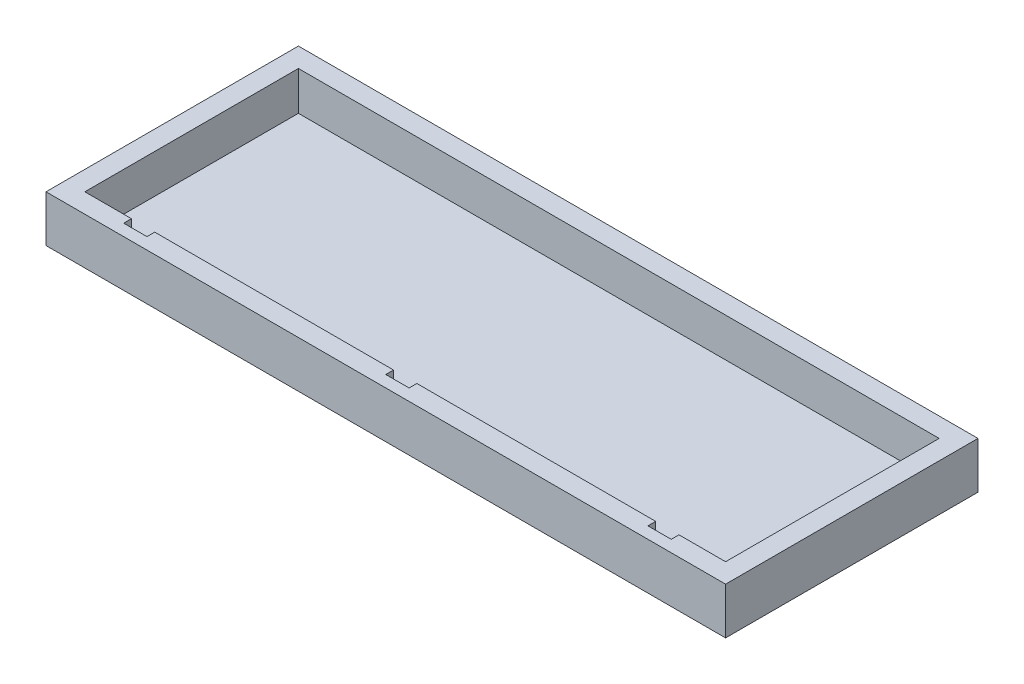
ISO-10303-21;
HEADER;
FILE_DESCRIPTION(('STEP AP214'),'2;1');
FILE_NAME('part.step','',(''),(''),'','','');
FILE_SCHEMA(('AUTOMOTIVE_DESIGN { 1 0 10303 214 1 1 1 1 }'));
ENDSEC;
DATA;
#1=APPLICATION_CONTEXT('core data for automotive mechanical design processes');
#2=APPLICATION_PROTOCOL_DEFINITION('international standard','automotive_design',2000,#1);
#3=PRODUCT_CONTEXT('',#1,'mechanical');
#4=PRODUCT('Part','Part','',(#3));
#5=PRODUCT_RELATED_PRODUCT_CATEGORY('part','',(#4));
#6=PRODUCT_DEFINITION_FORMATION('','',#4);
#7=PRODUCT_DEFINITION_CONTEXT('part definition',#1,'design');
#8=PRODUCT_DEFINITION('design','',#6,#7);
#9=PRODUCT_DEFINITION_SHAPE('','',#8);
#10=(LENGTH_UNIT() NAMED_UNIT(*) SI_UNIT(.MILLI.,.METRE.));
#11=(NAMED_UNIT(*) PLANE_ANGLE_UNIT() SI_UNIT($,.RADIAN.));
#12=(NAMED_UNIT(*) SI_UNIT($,.STERADIAN.) SOLID_ANGLE_UNIT());
#13=UNCERTAINTY_MEASURE_WITH_UNIT(LENGTH_MEASURE(1.E-05),#10,'distance_accuracy_value','');
#14=(GEOMETRIC_REPRESENTATION_CONTEXT(3) GLOBAL_UNCERTAINTY_ASSIGNED_CONTEXT((#13)) GLOBAL_UNIT_ASSIGNED_CONTEXT((#10,
#11,#12)) REPRESENTATION_CONTEXT('',''));
#15=CARTESIAN_POINT('',(0.,0.,0.));
#16=DIRECTION('',(0.,0.,1.));
#17=DIRECTION('',(1.,0.,0.));
#18=AXIS2_PLACEMENT_3D('',#15,#16,#17);
#19=CARTESIAN_POINT('',(82.5,2.,27.5));
#20=DIRECTION('',(0.,0.,1.));
#21=DIRECTION('',(1.,0.,0.));
#22=AXIS2_PLACEMENT_3D('',#19,#20,#21);
#23=PLANE('',#22);
#24=DIRECTION('',(1.,0.,0.));
#25=VECTOR('',#24,1.);
#26=CARTESIAN_POINT('',(82.5,12.,27.5));
#27=LINE('',#26,#25);
#28=CARTESIAN_POINT('',(-82.5,12.,27.5));
#29=VERTEX_POINT('',#28);
#30=CARTESIAN_POINT('',(-70.5,12.,27.5));
#31=VERTEX_POINT('',#30);
#32=EDGE_CURVE('E290',#29,#31,#27,.T.);
#33=ORIENTED_EDGE('',*,*,#32,.T.);
#34=DIRECTION('',(0.,1.,0.));
#35=VECTOR('',#34,1.);
#36=CARTESIAN_POINT('',(-70.5,2.,27.5));
#37=LINE('',#36,#35);
#38=CARTESIAN_POINT('',(-70.5,2.,27.5));
#39=VERTEX_POINT('',#38);
#40=EDGE_CURVE('E187',#39,#31,#37,.T.);
#41=ORIENTED_EDGE('',*,*,#40,.F.);
#42=DIRECTION('',(1.,0.,0.));
#43=VECTOR('',#42,1.);
#44=CARTESIAN_POINT('',(82.5,2.,27.5));
#45=LINE('',#44,#43);
#46=CARTESIAN_POINT('',(-82.5,2.,27.5));
#47=VERTEX_POINT('',#46);
#48=EDGE_CURVE('E276',#47,#39,#45,.T.);
#49=ORIENTED_EDGE('',*,*,#48,.F.);
#50=DIRECTION('',(0.,1.,0.));
#51=VECTOR('',#50,1.);
#52=CARTESIAN_POINT('',(-82.5,2.,27.5));
#53=LINE('',#52,#51);
#54=EDGE_CURVE('E287',#47,#29,#53,.T.);
#55=ORIENTED_EDGE('',*,*,#54,.T.);
#56=EDGE_LOOP('',(#33,#41,#49,#55));
#57=FACE_BOUND('',#56,.T.);
#58=ADVANCED_FACE('F44',(#57),#23,.F.);
#59=CARTESIAN_POINT('',(3.,12.,27.5));
#60=VERTEX_POINT('',#59);
#61=CARTESIAN_POINT('',(64.5,12.,27.5));
#62=VERTEX_POINT('',#61);
#63=EDGE_CURVE('E294',#60,#62,#27,.T.);
#64=ORIENTED_EDGE('',*,*,#63,.T.);
#65=DIRECTION('',(0.,1.,0.));
#66=VECTOR('',#65,1.);
#67=CARTESIAN_POINT('',(64.5,2.,27.5));
#68=LINE('',#67,#66);
#69=CARTESIAN_POINT('',(64.5,2.,27.5));
#70=VERTEX_POINT('',#69);
#71=EDGE_CURVE('E215',#70,#62,#68,.T.);
#72=ORIENTED_EDGE('',*,*,#71,.F.);
#73=CARTESIAN_POINT('',(3.,2.,27.5));
#74=VERTEX_POINT('',#73);
#75=EDGE_CURVE('E281',#74,#70,#45,.T.);
#76=ORIENTED_EDGE('',*,*,#75,.F.);
#77=DIRECTION('',(0.,-1.,0.));
#78=VECTOR('',#77,1.);
#79=CARTESIAN_POINT('',(3.,12.,27.5));
#80=LINE('',#79,#78);
#81=EDGE_CURVE('E247',#60,#74,#80,.T.);
#82=ORIENTED_EDGE('',*,*,#81,.F.);
#83=EDGE_LOOP('',(#64,#72,#76,#82));
#84=FACE_BOUND('',#83,.T.);
#85=ADVANCED_FACE('F359',(#84),#23,.F.);
#86=CARTESIAN_POINT('',(-64.5,2.,27.5));
#87=VERTEX_POINT('',#86);
#88=CARTESIAN_POINT('',(-3.,2.,27.5));
#89=VERTEX_POINT('',#88);
#90=EDGE_CURVE('E280',#87,#89,#45,.T.);
#91=ORIENTED_EDGE('',*,*,#90,.F.);
#92=DIRECTION('',(0.,-1.,0.));
#93=VECTOR('',#92,1.);
#94=CARTESIAN_POINT('',(-64.5,2.,27.5));
#95=LINE('',#94,#93);
#96=CARTESIAN_POINT('',(-64.5,12.,27.5));
#97=VERTEX_POINT('',#96);
#98=EDGE_CURVE('E59',#97,#87,#95,.T.);
#99=ORIENTED_EDGE('',*,*,#98,.F.);
#100=CARTESIAN_POINT('',(-3.,12.,27.5));
#101=VERTEX_POINT('',#100);
#102=EDGE_CURVE('E293',#97,#101,#27,.T.);
#103=ORIENTED_EDGE('',*,*,#102,.T.);
#104=DIRECTION('',(0.,1.,0.));
#105=VECTOR('',#104,1.);
#106=CARTESIAN_POINT('',(-3.,12.,27.5));
#107=LINE('',#106,#105);
#108=EDGE_CURVE('E236',#89,#101,#107,.T.);
#109=ORIENTED_EDGE('',*,*,#108,.F.);
#110=EDGE_LOOP('',(#91,#99,#103,#109));
#111=FACE_BOUND('',#110,.T.);
#112=ADVANCED_FACE('F357',(#111),#23,.F.);
#113=CARTESIAN_POINT('',(87.5,12.,32.5));
#114=DIRECTION('',(-1.,0.,0.));
#115=DIRECTION('',(0.,0.,1.));
#116=AXIS2_PLACEMENT_3D('',#113,#114,#115);
#117=PLANE('',#116);
#118=DIRECTION('',(0.,0.,-1.));
#119=VECTOR('',#118,1.);
#120=CARTESIAN_POINT('',(87.5,0.,32.5));
#121=LINE('',#120,#119);
#122=CARTESIAN_POINT('',(87.5,0.,32.5));
#123=VERTEX_POINT('',#122);
#124=CARTESIAN_POINT('',(87.5,0.,-32.5));
#125=VERTEX_POINT('',#124);
#126=EDGE_CURVE('E301',#123,#125,#121,.T.);
#127=ORIENTED_EDGE('',*,*,#126,.T.);
#128=DIRECTION('',(0.,-1.,0.));
#129=VECTOR('',#128,1.);
#130=CARTESIAN_POINT('',(87.5,12.,-32.5));
#131=LINE('',#130,#129);
#132=CARTESIAN_POINT('',(87.5,12.,-32.5));
#133=VERTEX_POINT('',#132);
#134=EDGE_CURVE('E11',#133,#125,#131,.T.);
#135=ORIENTED_EDGE('',*,*,#134,.F.);
#136=DIRECTION('',(0.,0.,-1.));
#137=VECTOR('',#136,1.);
#138=CARTESIAN_POINT('',(87.5,12.,32.5));
#139=LINE('',#138,#137);
#140=CARTESIAN_POINT('',(87.5,12.,32.5));
#141=VERTEX_POINT('',#140);
#142=EDGE_CURVE('E309',#141,#133,#139,.T.);
#143=ORIENTED_EDGE('',*,*,#142,.F.);
#144=DIRECTION('',(0.,-1.,0.));
#145=VECTOR('',#144,1.);
#146=CARTESIAN_POINT('',(87.5,12.,32.5));
#147=LINE('',#146,#145);
#148=EDGE_CURVE('E319',#141,#123,#147,.T.);
#149=ORIENTED_EDGE('',*,*,#148,.T.);
#150=EDGE_LOOP('',(#127,#135,#143,#149));
#151=FACE_BOUND('',#150,.T.);
#152=ADVANCED_FACE('F46',(#151),#117,.F.);
#153=CARTESIAN_POINT('',(-87.5,12.,-32.5));
#154=DIRECTION('',(0.,0.,1.));
#155=DIRECTION('',(1.,0.,0.));
#156=AXIS2_PLACEMENT_3D('',#153,#154,#155);
#157=PLANE('',#156);
#158=DIRECTION('',(-1.,0.,0.));
#159=VECTOR('',#158,1.);
#160=CARTESIAN_POINT('',(-87.5,0.,-32.5));
#161=LINE('',#160,#159);
#162=CARTESIAN_POINT('',(-87.5,0.,-32.5));
#163=VERTEX_POINT('',#162);
#164=EDGE_CURVE('E322',#125,#163,#161,.T.);
#165=ORIENTED_EDGE('',*,*,#164,.T.);
#166=DIRECTION('',(0.,-1.,0.));
#167=VECTOR('',#166,1.);
#168=CARTESIAN_POINT('',(-87.5,12.,-32.5));
#169=LINE('',#168,#167);
#170=CARTESIAN_POINT('',(-87.5,12.,-32.5));
#171=VERTEX_POINT('',#170);
#172=EDGE_CURVE('E52',#171,#163,#169,.T.);
#173=ORIENTED_EDGE('',*,*,#172,.F.);
#174=DIRECTION('',(-1.,0.,0.));
#175=VECTOR('',#174,1.);
#176=CARTESIAN_POINT('',(-87.5,12.,-32.5));
#177=LINE('',#176,#175);
#178=EDGE_CURVE('E312',#133,#171,#177,.T.);
#179=ORIENTED_EDGE('',*,*,#178,.F.);
#180=ORIENTED_EDGE('',*,*,#134,.T.);
#181=EDGE_LOOP('',(#165,#173,#179,#180));
#182=FACE_BOUND('',#181,.T.);
#183=ADVANCED_FACE('F350',(#182),#157,.F.);
#184=CARTESIAN_POINT('',(-87.5,12.,32.5));
#185=DIRECTION('',(1.,0.,0.));
#186=DIRECTION('',(0.,0.,-1.));
#187=AXIS2_PLACEMENT_3D('',#184,#185,#186);
#188=PLANE('',#187);
#189=DIRECTION('',(0.,0.,1.));
#190=VECTOR('',#189,1.);
#191=CARTESIAN_POINT('',(-87.5,0.,32.5));
#192=LINE('',#191,#190);
#193=CARTESIAN_POINT('',(-87.5,0.,32.5));
#194=VERTEX_POINT('',#193);
#195=EDGE_CURVE('E324',#163,#194,#192,.T.);
#196=ORIENTED_EDGE('',*,*,#195,.T.);
#197=DIRECTION('',(0.,-1.,0.));
#198=VECTOR('',#197,1.);
#199=CARTESIAN_POINT('',(-87.5,12.,32.5));
#200=LINE('',#199,#198);
#201=CARTESIAN_POINT('',(-87.5,12.,32.5));
#202=VERTEX_POINT('',#201);
#203=EDGE_CURVE('E329',#202,#194,#200,.T.);
#204=ORIENTED_EDGE('',*,*,#203,.F.);
#205=DIRECTION('',(0.,0.,1.));
#206=VECTOR('',#205,1.);
#207=CARTESIAN_POINT('',(-87.5,12.,32.5));
#208=LINE('',#207,#206);
#209=EDGE_CURVE('E315',#171,#202,#208,.T.);
#210=ORIENTED_EDGE('',*,*,#209,.F.);
#211=ORIENTED_EDGE('',*,*,#172,.T.);
#212=EDGE_LOOP('',(#196,#204,#210,#211));
#213=FACE_BOUND('',#212,.T.);
#214=ADVANCED_FACE('F336',(#213),#188,.F.);
#215=CARTESIAN_POINT('',(-87.5,12.,32.5));
#216=DIRECTION('',(0.,0.,-1.));
#217=DIRECTION('',(-1.,0.,0.));
#218=AXIS2_PLACEMENT_3D('',#215,#216,#217);
#219=PLANE('',#218);
#220=DIRECTION('',(1.,0.,0.));
#221=VECTOR('',#220,1.);
#222=CARTESIAN_POINT('',(-87.5,0.,32.5));
#223=LINE('',#222,#221);
#224=EDGE_CURVE('E313',#194,#123,#223,.T.);
#225=ORIENTED_EDGE('',*,*,#224,.T.);
#226=ORIENTED_EDGE('',*,*,#148,.F.);
#227=DIRECTION('',(1.,0.,0.));
#228=VECTOR('',#227,1.);
#229=CARTESIAN_POINT('',(-87.5,12.,32.5));
#230=LINE('',#229,#228);
#231=EDGE_CURVE('E317',#202,#141,#230,.T.);
#232=ORIENTED_EDGE('',*,*,#231,.F.);
#233=ORIENTED_EDGE('',*,*,#203,.T.);
#234=EDGE_LOOP('',(#225,#226,#232,#233));
#235=FACE_BOUND('',#234,.T.);
#236=ADVANCED_FACE('F345',(#235),#219,.F.);
#237=CARTESIAN_POINT('',(0.,12.,0.));
#238=DIRECTION('',(0.,-1.,0.));
#239=DIRECTION('',(0.,0.,-1.));
#240=AXIS2_PLACEMENT_3D('',#237,#238,#239);
#241=PLANE('',#240);
#242=DIRECTION('',(1.,0.,0.));
#243=VECTOR('',#242,1.);
#244=CARTESIAN_POINT('',(-64.5,12.,29.5));
#245=LINE('',#244,#243);
#246=CARTESIAN_POINT('',(-70.5,12.,29.5));
#247=VERTEX_POINT('',#246);
#248=CARTESIAN_POINT('',(-64.5,12.,29.5));
#249=VERTEX_POINT('',#248);
#250=EDGE_CURVE('E199',#247,#249,#245,.T.);
#251=ORIENTED_EDGE('',*,*,#250,.F.);
#252=DIRECTION('',(0.,0.,-1.));
#253=VECTOR('',#252,1.);
#254=CARTESIAN_POINT('',(-70.5,12.,29.5));
#255=LINE('',#254,#253);
#256=EDGE_CURVE('E181',#247,#31,#255,.T.);
#257=ORIENTED_EDGE('',*,*,#256,.T.);
#258=ORIENTED_EDGE('',*,*,#32,.F.);
#259=DIRECTION('',(0.,0.,1.));
#260=VECTOR('',#259,1.);
#261=CARTESIAN_POINT('',(-82.5,12.,27.5));
#262=LINE('',#261,#260);
#263=CARTESIAN_POINT('',(-82.5,12.,-27.5));
#264=VERTEX_POINT('',#263);
#265=EDGE_CURVE('E263',#264,#29,#262,.T.);
#266=ORIENTED_EDGE('',*,*,#265,.F.);
#267=DIRECTION('',(-1.,0.,0.));
#268=VECTOR('',#267,1.);
#269=CARTESIAN_POINT('',(82.5,12.,-27.5));
#270=LINE('',#269,#268);
#271=CARTESIAN_POINT('',(82.5,12.,-27.5));
#272=VERTEX_POINT('',#271);
#273=EDGE_CURVE('E275',#272,#264,#270,.T.);
#274=ORIENTED_EDGE('',*,*,#273,.F.);
#275=DIRECTION('',(0.,0.,-1.));
#276=VECTOR('',#275,1.);
#277=CARTESIAN_POINT('',(82.5,12.,27.5));
#278=LINE('',#277,#276);
#279=CARTESIAN_POINT('',(82.5,12.,27.5));
#280=VERTEX_POINT('',#279);
#281=EDGE_CURVE('E292',#280,#272,#278,.T.);
#282=ORIENTED_EDGE('',*,*,#281,.F.);
#283=CARTESIAN_POINT('',(70.5,12.,27.5));
#284=VERTEX_POINT('',#283);
#285=EDGE_CURVE('E289',#284,#280,#27,.T.);
#286=ORIENTED_EDGE('',*,*,#285,.F.);
#287=DIRECTION('',(0.,0.,-1.));
#288=VECTOR('',#287,1.);
#289=CARTESIAN_POINT('',(70.5,12.,29.5));
#290=LINE('',#289,#288);
#291=CARTESIAN_POINT('',(70.5,12.,29.5));
#292=VERTEX_POINT('',#291);
#293=EDGE_CURVE('E239',#292,#284,#290,.T.);
#294=ORIENTED_EDGE('',*,*,#293,.F.);
#295=DIRECTION('',(1.,0.,0.));
#296=VECTOR('',#295,1.);
#297=CARTESIAN_POINT('',(70.5,12.,29.5));
#298=LINE('',#297,#296);
#299=CARTESIAN_POINT('',(64.5,12.,29.5));
#300=VERTEX_POINT('',#299);
#301=EDGE_CURVE('E222',#300,#292,#298,.T.);
#302=ORIENTED_EDGE('',*,*,#301,.F.);
#303=DIRECTION('',(0.,0.,-1.));
#304=VECTOR('',#303,1.);
#305=CARTESIAN_POINT('',(64.5,12.,29.5));
#306=LINE('',#305,#304);
#307=EDGE_CURVE('E231',#300,#62,#306,.T.);
#308=ORIENTED_EDGE('',*,*,#307,.T.);
#309=ORIENTED_EDGE('',*,*,#63,.F.);
#310=DIRECTION('',(0.,0.,-1.));
#311=VECTOR('',#310,1.);
#312=CARTESIAN_POINT('',(3.,12.,29.5));
#313=LINE('',#312,#311);
#314=CARTESIAN_POINT('',(3.,12.,29.5));
#315=VERTEX_POINT('',#314);
#316=EDGE_CURVE('E267',#315,#60,#313,.T.);
#317=ORIENTED_EDGE('',*,*,#316,.F.);
#318=DIRECTION('',(1.,0.,0.));
#319=VECTOR('',#318,1.);
#320=CARTESIAN_POINT('',(3.,12.,29.5));
#321=LINE('',#320,#319);
#322=CARTESIAN_POINT('',(-3.,12.,29.5));
#323=VERTEX_POINT('',#322);
#324=EDGE_CURVE('E246',#323,#315,#321,.T.);
#325=ORIENTED_EDGE('',*,*,#324,.F.);
#326=DIRECTION('',(0.,0.,-1.));
#327=VECTOR('',#326,1.);
#328=CARTESIAN_POINT('',(-3.,12.,29.5));
#329=LINE('',#328,#327);
#330=EDGE_CURVE('E256',#323,#101,#329,.T.);
#331=ORIENTED_EDGE('',*,*,#330,.T.);
#332=ORIENTED_EDGE('',*,*,#102,.F.);
#333=DIRECTION('',(0.,0.,-1.));
#334=VECTOR('',#333,1.);
#335=CARTESIAN_POINT('',(-64.5,12.,29.5));
#336=LINE('',#335,#334);
#337=EDGE_CURVE('E192',#249,#97,#336,.T.);
#338=ORIENTED_EDGE('',*,*,#337,.F.);
#339=EDGE_LOOP('',(#251,#257,#258,#266,#274,#282,#286,#294,#302,#308,#309,#317,#325,#331,#332,#338));
#340=FACE_BOUND('',#339,.T.);
#341=ORIENTED_EDGE('',*,*,#142,.T.);
#342=ORIENTED_EDGE('',*,*,#178,.T.);
#343=ORIENTED_EDGE('',*,*,#209,.T.);
#344=ORIENTED_EDGE('',*,*,#231,.T.);
#345=EDGE_LOOP('',(#341,#342,#343,#344));
#346=FACE_BOUND('',#345,.T.);
#347=ADVANCED_FACE('F203',(#340,#346),#241,.F.);
#348=CARTESIAN_POINT('',(0.,0.,0.));
#349=DIRECTION('',(0.,-1.,0.));
#350=DIRECTION('',(0.,0.,-1.));
#351=AXIS2_PLACEMENT_3D('',#348,#349,#350);
#352=PLANE('',#351);
#353=ORIENTED_EDGE('',*,*,#126,.F.);
#354=ORIENTED_EDGE('',*,*,#224,.F.);
#355=ORIENTED_EDGE('',*,*,#195,.F.);
#356=ORIENTED_EDGE('',*,*,#164,.F.);
#357=EDGE_LOOP('',(#353,#354,#355,#356));
#358=FACE_BOUND('',#357,.T.);
#359=ADVANCED_FACE('F342',(#358),#352,.T.);
#360=CARTESIAN_POINT('',(-82.5,2.,27.5));
#361=DIRECTION('',(-1.,0.,0.));
#362=DIRECTION('',(0.,0.,1.));
#363=AXIS2_PLACEMENT_3D('',#360,#361,#362);
#364=PLANE('',#363);
#365=ORIENTED_EDGE('',*,*,#265,.T.);
#366=ORIENTED_EDGE('',*,*,#54,.F.);
#367=DIRECTION('',(0.,0.,1.));
#368=VECTOR('',#367,1.);
#369=CARTESIAN_POINT('',(-82.5,2.,27.5));
#370=LINE('',#369,#368);
#371=CARTESIAN_POINT('',(-82.5,2.,-27.5));
#372=VERTEX_POINT('',#371);
#373=EDGE_CURVE('E271',#372,#47,#370,.T.);
#374=ORIENTED_EDGE('',*,*,#373,.F.);
#375=DIRECTION('',(0.,1.,0.));
#376=VECTOR('',#375,1.);
#377=CARTESIAN_POINT('',(-82.5,2.,-27.5));
#378=LINE('',#377,#376);
#379=EDGE_CURVE('E299',#372,#264,#378,.T.);
#380=ORIENTED_EDGE('',*,*,#379,.T.);
#381=EDGE_LOOP('',(#365,#366,#374,#380));
#382=FACE_BOUND('',#381,.T.);
#383=ADVANCED_FACE('F405',(#382),#364,.F.);
#384=CARTESIAN_POINT('',(82.5,2.,-27.5));
#385=DIRECTION('',(0.,0.,-1.));
#386=DIRECTION('',(-1.,0.,0.));
#387=AXIS2_PLACEMENT_3D('',#384,#385,#386);
#388=PLANE('',#387);
#389=ORIENTED_EDGE('',*,*,#273,.T.);
#390=ORIENTED_EDGE('',*,*,#379,.F.);
#391=DIRECTION('',(-1.,0.,0.));
#392=VECTOR('',#391,1.);
#393=CARTESIAN_POINT('',(82.5,2.,-27.5));
#394=LINE('',#393,#392);
#395=CARTESIAN_POINT('',(82.5,2.,-27.5));
#396=VERTEX_POINT('',#395);
#397=EDGE_CURVE('E284',#396,#372,#394,.T.);
#398=ORIENTED_EDGE('',*,*,#397,.F.);
#399=DIRECTION('',(0.,1.,0.));
#400=VECTOR('',#399,1.);
#401=CARTESIAN_POINT('',(82.5,2.,-27.5));
#402=LINE('',#401,#400);
#403=EDGE_CURVE('E302',#396,#272,#402,.T.);
#404=ORIENTED_EDGE('',*,*,#403,.T.);
#405=EDGE_LOOP('',(#389,#390,#398,#404));
#406=FACE_BOUND('',#405,.T.);
#407=ADVANCED_FACE('F383',(#406),#388,.F.);
#408=CARTESIAN_POINT('',(82.5,2.,27.5));
#409=DIRECTION('',(1.,0.,0.));
#410=DIRECTION('',(0.,0.,-1.));
#411=AXIS2_PLACEMENT_3D('',#408,#409,#410);
#412=PLANE('',#411);
#413=ORIENTED_EDGE('',*,*,#281,.T.);
#414=ORIENTED_EDGE('',*,*,#403,.F.);
#415=DIRECTION('',(0.,0.,-1.));
#416=VECTOR('',#415,1.);
#417=CARTESIAN_POINT('',(82.5,2.,27.5));
#418=LINE('',#417,#416);
#419=CARTESIAN_POINT('',(82.5,2.,27.5));
#420=VERTEX_POINT('',#419);
#421=EDGE_CURVE('E279',#420,#396,#418,.T.);
#422=ORIENTED_EDGE('',*,*,#421,.F.);
#423=DIRECTION('',(0.,1.,0.));
#424=VECTOR('',#423,1.);
#425=CARTESIAN_POINT('',(82.5,2.,27.5));
#426=LINE('',#425,#424);
#427=EDGE_CURVE('E304',#420,#280,#426,.T.);
#428=ORIENTED_EDGE('',*,*,#427,.T.);
#429=EDGE_LOOP('',(#413,#414,#422,#428));
#430=FACE_BOUND('',#429,.T.);
#431=ADVANCED_FACE('F373',(#430),#412,.F.);
#432=CARTESIAN_POINT('',(70.5,2.,27.5));
#433=VERTEX_POINT('',#432);
#434=EDGE_CURVE('E274',#433,#420,#45,.T.);
#435=ORIENTED_EDGE('',*,*,#434,.F.);
#436=DIRECTION('',(0.,-1.,0.));
#437=VECTOR('',#436,1.);
#438=CARTESIAN_POINT('',(70.5,2.,27.5));
#439=LINE('',#438,#437);
#440=EDGE_CURVE('E67',#284,#433,#439,.T.);
#441=ORIENTED_EDGE('',*,*,#440,.F.);
#442=ORIENTED_EDGE('',*,*,#285,.T.);
#443=ORIENTED_EDGE('',*,*,#427,.F.);
#444=EDGE_LOOP('',(#435,#441,#442,#443));
#445=FACE_BOUND('',#444,.T.);
#446=ADVANCED_FACE('F362',(#445),#23,.F.);
#447=CARTESIAN_POINT('',(0.,2.,0.));
#448=DIRECTION('',(0.,1.,0.));
#449=DIRECTION('',(0.,0.,1.));
#450=AXIS2_PLACEMENT_3D('',#447,#448,#449);
#451=PLANE('',#450);
#452=ORIENTED_EDGE('',*,*,#373,.T.);
#453=ORIENTED_EDGE('',*,*,#48,.T.);
#454=DIRECTION('',(0.,0.,-1.));
#455=VECTOR('',#454,1.);
#456=CARTESIAN_POINT('',(-70.5,2.,29.5));
#457=LINE('',#456,#455);
#458=CARTESIAN_POINT('',(-70.5,2.,29.5));
#459=VERTEX_POINT('',#458);
#460=EDGE_CURVE('E213',#459,#39,#457,.T.);
#461=ORIENTED_EDGE('',*,*,#460,.F.);
#462=DIRECTION('',(-1.,0.,0.));
#463=VECTOR('',#462,1.);
#464=CARTESIAN_POINT('',(-64.5,2.,29.5));
#465=LINE('',#464,#463);
#466=CARTESIAN_POINT('',(-64.5,2.,29.5));
#467=VERTEX_POINT('',#466);
#468=EDGE_CURVE('E193',#467,#459,#465,.T.);
#469=ORIENTED_EDGE('',*,*,#468,.F.);
#470=DIRECTION('',(0.,0.,-1.));
#471=VECTOR('',#470,1.);
#472=CARTESIAN_POINT('',(-64.5,2.,29.5));
#473=LINE('',#472,#471);
#474=EDGE_CURVE('E216',#467,#87,#473,.T.);
#475=ORIENTED_EDGE('',*,*,#474,.T.);
#476=ORIENTED_EDGE('',*,*,#90,.T.);
#477=DIRECTION('',(0.,0.,-1.));
#478=VECTOR('',#477,1.);
#479=CARTESIAN_POINT('',(-3.,2.,29.5));
#480=LINE('',#479,#478);
#481=CARTESIAN_POINT('',(-3.,2.,29.5));
#482=VERTEX_POINT('',#481);
#483=EDGE_CURVE('E260',#482,#89,#480,.T.);
#484=ORIENTED_EDGE('',*,*,#483,.F.);
#485=DIRECTION('',(-1.,0.,0.));
#486=VECTOR('',#485,1.);
#487=CARTESIAN_POINT('',(3.,2.,29.5));
#488=LINE('',#487,#486);
#489=CARTESIAN_POINT('',(3.,2.,29.5));
#490=VERTEX_POINT('',#489);
#491=EDGE_CURVE('E253',#490,#482,#488,.T.);
#492=ORIENTED_EDGE('',*,*,#491,.F.);
#493=DIRECTION('',(0.,0.,-1.));
#494=VECTOR('',#493,1.);
#495=CARTESIAN_POINT('',(3.,2.,29.5));
#496=LINE('',#495,#494);
#497=EDGE_CURVE('E264',#490,#74,#496,.T.);
#498=ORIENTED_EDGE('',*,*,#497,.T.);
#499=ORIENTED_EDGE('',*,*,#75,.T.);
#500=DIRECTION('',(0.,0.,-1.));
#501=VECTOR('',#500,1.);
#502=CARTESIAN_POINT('',(64.5,2.,29.5));
#503=LINE('',#502,#501);
#504=CARTESIAN_POINT('',(64.5,2.,29.5));
#505=VERTEX_POINT('',#504);
#506=EDGE_CURVE('E234',#505,#70,#503,.T.);
#507=ORIENTED_EDGE('',*,*,#506,.F.);
#508=DIRECTION('',(-1.,0.,0.));
#509=VECTOR('',#508,1.);
#510=CARTESIAN_POINT('',(70.5,2.,29.5));
#511=LINE('',#510,#509);
#512=CARTESIAN_POINT('',(70.5,2.,29.5));
#513=VERTEX_POINT('',#512);
#514=EDGE_CURVE('E228',#513,#505,#511,.T.);
#515=ORIENTED_EDGE('',*,*,#514,.F.);
#516=DIRECTION('',(0.,0.,-1.));
#517=VECTOR('',#516,1.);
#518=CARTESIAN_POINT('',(70.5,2.,29.5));
#519=LINE('',#518,#517);
#520=EDGE_CURVE('E237',#513,#433,#519,.T.);
#521=ORIENTED_EDGE('',*,*,#520,.T.);
#522=ORIENTED_EDGE('',*,*,#434,.T.);
#523=ORIENTED_EDGE('',*,*,#421,.T.);
#524=ORIENTED_EDGE('',*,*,#397,.T.);
#525=EDGE_LOOP('',(#452,#453,#461,#469,#475,#476,#484,#492,#498,#499,#507,#515,#521,#522,#523,#524));
#526=FACE_BOUND('',#525,.T.);
#527=ADVANCED_FACE('F372',(#526),#451,.T.);
#528=CARTESIAN_POINT('',(-3.,12.,29.5));
#529=DIRECTION('',(-1.,0.,0.));
#530=DIRECTION('',(0.,0.,1.));
#531=AXIS2_PLACEMENT_3D('',#528,#529,#530);
#532=PLANE('',#531);
#533=ORIENTED_EDGE('',*,*,#108,.T.);
#534=ORIENTED_EDGE('',*,*,#330,.F.);
#535=DIRECTION('',(0.,1.,0.));
#536=VECTOR('',#535,1.);
#537=CARTESIAN_POINT('',(-3.,12.,29.5));
#538=LINE('',#537,#536);
#539=EDGE_CURVE('E243',#482,#323,#538,.T.);
#540=ORIENTED_EDGE('',*,*,#539,.F.);
#541=ORIENTED_EDGE('',*,*,#483,.T.);
#542=EDGE_LOOP('',(#533,#534,#540,#541));
#543=FACE_BOUND('',#542,.T.);
#544=ADVANCED_FACE('F379',(#543),#532,.F.);
#545=CARTESIAN_POINT('',(3.,12.,29.5));
#546=DIRECTION('',(1.,0.,0.));
#547=DIRECTION('',(0.,0.,-1.));
#548=AXIS2_PLACEMENT_3D('',#545,#546,#547);
#549=PLANE('',#548);
#550=ORIENTED_EDGE('',*,*,#81,.T.);
#551=ORIENTED_EDGE('',*,*,#497,.F.);
#552=DIRECTION('',(0.,-1.,0.));
#553=VECTOR('',#552,1.);
#554=CARTESIAN_POINT('',(3.,12.,29.5));
#555=LINE('',#554,#553);
#556=EDGE_CURVE('E250',#315,#490,#555,.T.);
#557=ORIENTED_EDGE('',*,*,#556,.F.);
#558=ORIENTED_EDGE('',*,*,#316,.T.);
#559=EDGE_LOOP('',(#550,#551,#557,#558));
#560=FACE_BOUND('',#559,.T.);
#561=ADVANCED_FACE('F437',(#560),#549,.F.);
#562=CARTESIAN_POINT('',(0.,0.,29.5));
#563=DIRECTION('',(0.,0.,-1.));
#564=DIRECTION('',(-1.,0.,0.));
#565=AXIS2_PLACEMENT_3D('',#562,#563,#564);
#566=PLANE('',#565);
#567=ORIENTED_EDGE('',*,*,#539,.T.);
#568=ORIENTED_EDGE('',*,*,#324,.T.);
#569=ORIENTED_EDGE('',*,*,#556,.T.);
#570=ORIENTED_EDGE('',*,*,#491,.T.);
#571=EDGE_LOOP('',(#567,#568,#569,#570));
#572=FACE_BOUND('',#571,.T.);
#573=ADVANCED_FACE('F415',(#572),#566,.T.);
#574=CARTESIAN_POINT('',(64.5,2.,29.5));
#575=DIRECTION('',(-1.,0.,0.));
#576=DIRECTION('',(0.,-1.,0.));
#577=AXIS2_PLACEMENT_3D('',#574,#575,#576);
#578=PLANE('',#577);
#579=ORIENTED_EDGE('',*,*,#71,.T.);
#580=ORIENTED_EDGE('',*,*,#307,.F.);
#581=DIRECTION('',(0.,1.,0.));
#582=VECTOR('',#581,1.);
#583=CARTESIAN_POINT('',(64.5,2.,29.5));
#584=LINE('',#583,#582);
#585=EDGE_CURVE('E219',#505,#300,#584,.T.);
#586=ORIENTED_EDGE('',*,*,#585,.F.);
#587=ORIENTED_EDGE('',*,*,#506,.T.);
#588=EDGE_LOOP('',(#579,#580,#586,#587));
#589=FACE_BOUND('',#588,.T.);
#590=ADVANCED_FACE('F422',(#589),#578,.F.);
#591=CARTESIAN_POINT('',(70.5,2.,29.5));
#592=DIRECTION('',(1.,0.,0.));
#593=DIRECTION('',(0.,0.,-1.));
#594=AXIS2_PLACEMENT_3D('',#591,#592,#593);
#595=PLANE('',#594);
#596=ORIENTED_EDGE('',*,*,#440,.T.);
#597=ORIENTED_EDGE('',*,*,#520,.F.);
#598=DIRECTION('',(0.,-1.,0.));
#599=VECTOR('',#598,1.);
#600=CARTESIAN_POINT('',(70.5,2.,29.5));
#601=LINE('',#600,#599);
#602=EDGE_CURVE('E225',#292,#513,#601,.T.);
#603=ORIENTED_EDGE('',*,*,#602,.F.);
#604=ORIENTED_EDGE('',*,*,#293,.T.);
#605=EDGE_LOOP('',(#596,#597,#603,#604));
#606=FACE_BOUND('',#605,.T.);
#607=ADVANCED_FACE('F426',(#606),#595,.F.);
#608=CARTESIAN_POINT('',(0.,0.,29.5));
#609=DIRECTION('',(0.,0.,1.));
#610=DIRECTION('',(1.,0.,0.));
#611=AXIS2_PLACEMENT_3D('',#608,#609,#610);
#612=PLANE('',#611);
#613=ORIENTED_EDGE('',*,*,#585,.T.);
#614=ORIENTED_EDGE('',*,*,#301,.T.);
#615=ORIENTED_EDGE('',*,*,#602,.T.);
#616=ORIENTED_EDGE('',*,*,#514,.T.);
#617=EDGE_LOOP('',(#613,#614,#615,#616));
#618=FACE_BOUND('',#617,.T.);
#619=ADVANCED_FACE('F425',(#618),#612,.F.);
#620=CARTESIAN_POINT('',(-70.5,2.,29.5));
#621=DIRECTION('',(-1.,0.,0.));
#622=DIRECTION('',(0.,0.,1.));
#623=AXIS2_PLACEMENT_3D('',#620,#621,#622);
#624=PLANE('',#623);
#625=ORIENTED_EDGE('',*,*,#40,.T.);
#626=ORIENTED_EDGE('',*,*,#256,.F.);
#627=DIRECTION('',(0.,1.,0.));
#628=VECTOR('',#627,1.);
#629=CARTESIAN_POINT('',(-70.5,2.,29.5));
#630=LINE('',#629,#628);
#631=EDGE_CURVE('E184',#459,#247,#630,.T.);
#632=ORIENTED_EDGE('',*,*,#631,.F.);
#633=ORIENTED_EDGE('',*,*,#460,.T.);
#634=EDGE_LOOP('',(#625,#626,#632,#633));
#635=FACE_BOUND('',#634,.T.);
#636=ADVANCED_FACE('F183',(#635),#624,.F.);
#637=CARTESIAN_POINT('',(-64.5,2.,29.5));
#638=DIRECTION('',(1.,0.,0.));
#639=DIRECTION('',(0.,0.,-1.));
#640=AXIS2_PLACEMENT_3D('',#637,#638,#639);
#641=PLANE('',#640);
#642=ORIENTED_EDGE('',*,*,#98,.T.);
#643=ORIENTED_EDGE('',*,*,#474,.F.);
#644=DIRECTION('',(0.,-1.,0.));
#645=VECTOR('',#644,1.);
#646=CARTESIAN_POINT('',(-64.5,2.,29.5));
#647=LINE('',#646,#645);
#648=EDGE_CURVE('E206',#249,#467,#647,.T.);
#649=ORIENTED_EDGE('',*,*,#648,.F.);
#650=ORIENTED_EDGE('',*,*,#337,.T.);
#651=EDGE_LOOP('',(#642,#643,#649,#650));
#652=FACE_BOUND('',#651,.T.);
#653=ADVANCED_FACE('F546',(#652),#641,.F.);
#654=CARTESIAN_POINT('',(0.,0.,29.5));
#655=DIRECTION('',(0.,0.,1.));
#656=DIRECTION('',(1.,0.,0.));
#657=AXIS2_PLACEMENT_3D('',#654,#655,#656);
#658=PLANE('',#657);
#659=ORIENTED_EDGE('',*,*,#631,.T.);
#660=ORIENTED_EDGE('',*,*,#250,.T.);
#661=ORIENTED_EDGE('',*,*,#648,.T.);
#662=ORIENTED_EDGE('',*,*,#468,.T.);
#663=EDGE_LOOP('',(#659,#660,#661,#662));
#664=FACE_BOUND('',#663,.T.);
#665=ADVANCED_FACE('F197',(#664),#658,.F.);
#666=CLOSED_SHELL('',(#58,#85,#112,#152,#183,#214,#236,#347,#359,#383,#407,#431,#446,#527,#544,
#561,#573,#590,#607,#619,#636,#653,#665));
#667=MANIFOLD_SOLID_BREP('B2',#666);
#668=ADVANCED_BREP_SHAPE_REPRESENTATION('',(#18,#667),#14);
#669=SHAPE_DEFINITION_REPRESENTATION(#9,#668);
ENDSEC;
END-ISO-10303-21;
